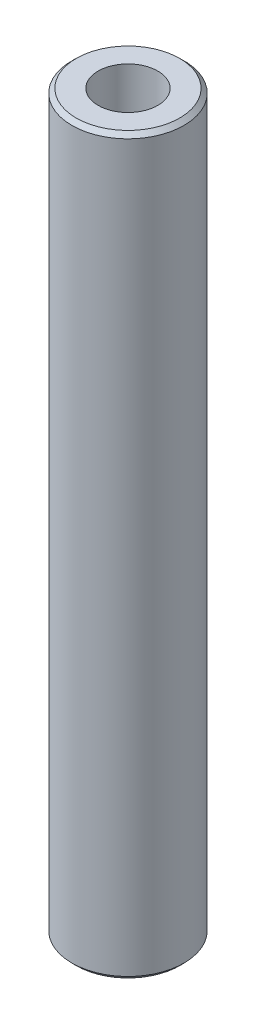
ISO-10303-21;
HEADER;
FILE_DESCRIPTION(('STEP AP214'),'2;1');
FILE_NAME('part.step','',(''),(''),'','','');
FILE_SCHEMA(('AUTOMOTIVE_DESIGN { 1 0 10303 214 1 1 1 1 }'));
ENDSEC;
DATA;
#1=APPLICATION_CONTEXT('core data for automotive mechanical design processes');
#2=APPLICATION_PROTOCOL_DEFINITION('international standard','automotive_design',2000,#1);
#3=PRODUCT_CONTEXT('',#1,'mechanical');
#4=PRODUCT('Part','Part','',(#3));
#5=PRODUCT_RELATED_PRODUCT_CATEGORY('part','',(#4));
#6=PRODUCT_DEFINITION_FORMATION('','',#4);
#7=PRODUCT_DEFINITION_CONTEXT('part definition',#1,'design');
#8=PRODUCT_DEFINITION('design','',#6,#7);
#9=PRODUCT_DEFINITION_SHAPE('','',#8);
#10=(LENGTH_UNIT() NAMED_UNIT(*) SI_UNIT(.MILLI.,.METRE.));
#11=(NAMED_UNIT(*) PLANE_ANGLE_UNIT() SI_UNIT($,.RADIAN.));
#12=(NAMED_UNIT(*) SI_UNIT($,.STERADIAN.) SOLID_ANGLE_UNIT());
#13=UNCERTAINTY_MEASURE_WITH_UNIT(LENGTH_MEASURE(1.E-05),#10,'distance_accuracy_value','');
#14=(GEOMETRIC_REPRESENTATION_CONTEXT(3) GLOBAL_UNCERTAINTY_ASSIGNED_CONTEXT((#13)) GLOBAL_UNIT_ASSIGNED_CONTEXT((#10,
#11,#12)) REPRESENTATION_CONTEXT('',''));
#15=CARTESIAN_POINT('',(0.,0.,0.));
#16=DIRECTION('',(0.,0.,1.));
#17=DIRECTION('',(1.,0.,0.));
#18=AXIS2_PLACEMENT_3D('',#15,#16,#17);
#19=CARTESIAN_POINT('',(0.,589.345693844291,0.));
#20=DIRECTION('',(0.,-1.,0.));
#21=DIRECTION('',(0.,0.,-1.));
#22=AXIS2_PLACEMENT_3D('',#19,#20,#21);
#23=CYLINDRICAL_SURFACE('',#22,45.);
#24=CARTESIAN_POINT('',(0.,585.949926731888,0.));
#25=DIRECTION('',(0.,1.,0.));
#26=DIRECTION('',(0.,0.,1.));
#27=AXIS2_PLACEMENT_3D('',#24,#25,#26);
#28=CIRCLE('',#27,45.);
#29=CARTESIAN_POINT('',(0.,585.949926731888,45.));
#30=VERTEX_POINT('',#29);
#31=EDGE_CURVE('E50',#30,#30,#28,.F.);
#32=ORIENTED_EDGE('',*,*,#31,.T.);
#33=EDGE_LOOP('',(#32));
#34=FACE_BOUND('',#33,.T.);
#35=CARTESIAN_POINT('',(0.,3.47621680951538,0.));
#36=DIRECTION('',(0.,1.,0.));
#37=DIRECTION('',(0.,0.,1.));
#38=AXIS2_PLACEMENT_3D('',#35,#36,#37);
#39=CIRCLE('',#38,45.);
#40=CARTESIAN_POINT('',(0.,3.47621680951538,45.));
#41=VERTEX_POINT('',#40);
#42=EDGE_CURVE('E51',#41,#41,#39,.T.);
#43=ORIENTED_EDGE('',*,*,#42,.T.);
#44=EDGE_LOOP('',(#43));
#45=FACE_BOUND('',#44,.T.);
#46=ADVANCED_FACE('F39',(#34,#45),#23,.T.);
#47=CARTESIAN_POINT('',(0.,589.345693844291,0.));
#48=DIRECTION('',(0.,1.,0.));
#49=DIRECTION('',(0.,0.,1.));
#50=AXIS2_PLACEMENT_3D('',#47,#48,#49);
#51=PLANE('',#50);
#52=CARTESIAN_POINT('',(0.,589.345693844291,0.));
#53=DIRECTION('',(0.,1.,0.));
#54=DIRECTION('',(0.,0.,1.));
#55=AXIS2_PLACEMENT_3D('',#52,#53,#54);
#56=CIRCLE('',#55,41.5237831904847);
#57=CARTESIAN_POINT('',(0.,589.345693844291,41.5237831904847));
#58=VERTEX_POINT('',#57);
#59=EDGE_CURVE('E54',#58,#58,#56,.T.);
#60=ORIENTED_EDGE('',*,*,#59,.T.);
#61=EDGE_LOOP('',(#60));
#62=FACE_BOUND('',#61,.T.);
#63=CARTESIAN_POINT('',(0.,589.345693844291,0.));
#64=DIRECTION('',(0.,1.,0.));
#65=DIRECTION('',(0.,0.,1.));
#66=AXIS2_PLACEMENT_3D('',#63,#64,#65);
#67=CIRCLE('',#66,23.9354806141811);
#68=CARTESIAN_POINT('',(0.,589.345693844291,23.9354806141811));
#69=VERTEX_POINT('',#68);
#70=EDGE_CURVE('E58',#69,#69,#67,.T.);
#71=ORIENTED_EDGE('',*,*,#70,.F.);
#72=EDGE_LOOP('',(#71));
#73=FACE_BOUND('',#72,.T.);
#74=ADVANCED_FACE('F69',(#62,#73),#51,.T.);
#75=CARTESIAN_POINT('',(0.,0.,0.));
#76=DIRECTION('',(0.,1.,0.));
#77=DIRECTION('',(0.,0.,1.));
#78=AXIS2_PLACEMENT_3D('',#75,#76,#77);
#79=PLANE('',#78);
#80=CARTESIAN_POINT('',(0.,0.,0.));
#81=DIRECTION('',(0.,1.,0.));
#82=DIRECTION('',(0.,0.,1.));
#83=AXIS2_PLACEMENT_3D('',#80,#81,#82);
#84=CIRCLE('',#83,41.6042328875967);
#85=CARTESIAN_POINT('',(0.,0.,41.6042328875967));
#86=VERTEX_POINT('',#85);
#87=EDGE_CURVE('E10',#86,#86,#84,.F.);
#88=ORIENTED_EDGE('',*,*,#87,.T.);
#89=EDGE_LOOP('',(#88));
#90=FACE_BOUND('',#89,.T.);
#91=CARTESIAN_POINT('',(0.,0.,0.));
#92=DIRECTION('',(0.,1.,0.));
#93=DIRECTION('',(0.,0.,1.));
#94=AXIS2_PLACEMENT_3D('',#91,#92,#93);
#95=CIRCLE('',#94,23.9354806141811);
#96=CARTESIAN_POINT('',(0.,0.,23.9354806141811));
#97=VERTEX_POINT('',#96);
#98=EDGE_CURVE('E63',#97,#97,#95,.T.);
#99=ORIENTED_EDGE('',*,*,#98,.T.);
#100=EDGE_LOOP('',(#99));
#101=FACE_BOUND('',#100,.T.);
#102=ADVANCED_FACE('F75',(#90,#101),#79,.F.);
#103=CARTESIAN_POINT('',(0.,589.345693844291,0.));
#104=DIRECTION('',(0.,-1.,0.));
#105=DIRECTION('',(0.,0.,-1.));
#106=AXIS2_PLACEMENT_3D('',#103,#104,#105);
#107=CYLINDRICAL_SURFACE('',#106,23.9354806141811);
#108=ORIENTED_EDGE('',*,*,#70,.T.);
#109=EDGE_LOOP('',(#108));
#110=FACE_BOUND('',#109,.T.);
#111=ORIENTED_EDGE('',*,*,#98,.F.);
#112=EDGE_LOOP('',(#111));
#113=FACE_BOUND('',#112,.T.);
#114=ADVANCED_FACE('F70',(#110,#113),#107,.F.);
#115=CARTESIAN_POINT('',(0.,589.345693844291,0.));
#116=DIRECTION('',(0.,-1.,0.));
#117=DIRECTION('',(0.,0.,-1.));
#118=AXIS2_PLACEMENT_3D('',#115,#116,#117);
#119=CONICAL_SURFACE('',#118,41.5237831904847,0.797104538597274);
#120=ORIENTED_EDGE('',*,*,#31,.F.);
#121=EDGE_LOOP('',(#120));
#122=FACE_BOUND('',#121,.T.);
#123=ORIENTED_EDGE('',*,*,#59,.F.);
#124=EDGE_LOOP('',(#123));
#125=FACE_BOUND('',#124,.T.);
#126=ADVANCED_FACE('F81',(#122,#125),#119,.T.);
#127=CARTESIAN_POINT('',(0.,3.47621680951538,0.));
#128=DIRECTION('',(0.,1.,0.));
#129=DIRECTION('',(0.,0.,1.));
#130=AXIS2_PLACEMENT_3D('',#127,#128,#129);
#131=CONICAL_SURFACE('',#130,45.,0.773691788197605);
#132=CARTESIAN_POINT('',(0.,0.,41.6042328875967));
#133=CARTESIAN_POINT('',(0.,0.0362105917657864,41.6396054616843));
#134=CARTESIAN_POINT('',(0.,0.072421183531571,41.6749780357718));
#135=CARTESIAN_POINT('',(0.,0.14484236706314,41.7457231839469));
#136=CARTESIAN_POINT('',(0.,0.181052958828925,41.7810957580344));
#137=CARTESIAN_POINT('',(0.,0.253474142360495,41.8518409062095));
#138=CARTESIAN_POINT('',(0.,0.28968473412628,41.887213480297));
#139=CARTESIAN_POINT('',(0.,0.362105917657852,41.9579586284721));
#140=CARTESIAN_POINT('',(0.,0.398316509423637,41.9933312025596));
#141=CARTESIAN_POINT('',(0.,0.470737692955207,42.0640763507347));
#142=CARTESIAN_POINT('',(0.,0.506948284720991,42.0994489248222));
#143=CARTESIAN_POINT('',(0.,0.579369468252562,42.1701940729973));
#144=CARTESIAN_POINT('',(0.,0.615580060018348,42.2055666470848));
#145=CARTESIAN_POINT('',(0.,0.688001243549918,42.2763117952599));
#146=CARTESIAN_POINT('',(0.,0.724211835315702,42.3116843693474));
#147=CARTESIAN_POINT('',(0.,0.796633018847272,42.3824295175225));
#148=CARTESIAN_POINT('',(0.,0.832843610613058,42.41780209161));
#149=CARTESIAN_POINT('',(0.,0.905264794144629,42.4885472397851));
#150=CARTESIAN_POINT('',(0.,0.941475385910414,42.5239198138726));
#151=CARTESIAN_POINT('',(0.,1.01389656944198,42.5946649620477));
#152=CARTESIAN_POINT('',(0.,1.05010716120777,42.6300375361352));
#153=CARTESIAN_POINT('',(0.,1.12252834473934,42.7007826843103));
#154=CARTESIAN_POINT('',(0.,1.15873893650512,42.7361552583978));
#155=CARTESIAN_POINT('',(0.,1.2311601200367,42.8069004065729));
#156=CARTESIAN_POINT('',(0.,1.26737071180248,42.8422729806604));
#157=CARTESIAN_POINT('',(0.,1.33979189533405,42.9130181288355));
#158=CARTESIAN_POINT('',(0.,1.37600248709984,42.948390702923));
#159=CARTESIAN_POINT('',(0.,1.44842367063141,43.0191358510981));
#160=CARTESIAN_POINT('',(0.,1.48463426239719,43.0545084251856));
#161=CARTESIAN_POINT('',(0.,1.55705544592876,43.1252535733607));
#162=CARTESIAN_POINT('',(0.,1.59326603769455,43.1606261474482));
#163=CARTESIAN_POINT('',(0.,1.66568722122612,43.2313712956233));
#164=CARTESIAN_POINT('',(0.,1.7018978129919,43.2667438697108));
#165=CARTESIAN_POINT('',(0.,1.77431899652347,43.3374890178859));
#166=CARTESIAN_POINT('',(0.,1.81052958828926,43.3728615919734));
#167=CARTESIAN_POINT('',(0.,1.88295077182083,43.4436067401485));
#168=CARTESIAN_POINT('',(0.,1.91916136358661,43.478979314236));
#169=CARTESIAN_POINT('',(0.,1.99158254711818,43.5497244624111));
#170=CARTESIAN_POINT('',(0.,2.02779313888397,43.5850970364986));
#171=CARTESIAN_POINT('',(0.,2.10021432241554,43.6558421846737));
#172=CARTESIAN_POINT('',(0.,2.13642491418133,43.6912147587612));
#173=CARTESIAN_POINT('',(0.,2.20884609771289,43.7619599069363));
#174=CARTESIAN_POINT('',(0.,2.24505668947868,43.7973324810238));
#175=CARTESIAN_POINT('',(0.,2.31747787301025,43.8680776291989));
#176=CARTESIAN_POINT('',(0.,2.35368846477604,43.9034502032864));
#177=CARTESIAN_POINT('',(0.,2.42610964830761,43.9741953514615));
#178=CARTESIAN_POINT('',(0.,2.46232024007339,44.0095679255491));
#179=CARTESIAN_POINT('',(0.,2.53474142360496,44.0803130737241));
#180=CARTESIAN_POINT('',(0.,2.57095201537075,44.1156856478117));
#181=CARTESIAN_POINT('',(0.,2.64337319890232,44.1864307959867));
#182=CARTESIAN_POINT('',(0.,2.6795837906681,44.2218033700743));
#183=CARTESIAN_POINT('',(0.,2.75200497419967,44.2925485182493));
#184=CARTESIAN_POINT('',(0.,2.78821556596546,44.3279210923369));
#185=CARTESIAN_POINT('',(0.,2.86063674949703,44.3986662405119));
#186=CARTESIAN_POINT('',(0.,2.89684734126281,44.4340388145995));
#187=CARTESIAN_POINT('',(0.,2.96926852479438,44.5047839627745));
#188=CARTESIAN_POINT('',(0.,3.00547911656017,44.5401565368621));
#189=CARTESIAN_POINT('',(0.,3.07790030009174,44.6109016850371));
#190=CARTESIAN_POINT('',(0.,3.11411089185752,44.6462742591247));
#191=CARTESIAN_POINT('',(0.,3.18653207538909,44.7170194072997));
#192=CARTESIAN_POINT('',(0.,3.22274266715488,44.7523919813873));
#193=CARTESIAN_POINT('',(0.,3.29516385068645,44.8231371295623));
#194=CARTESIAN_POINT('',(0.,3.33137444245223,44.8585097036499));
#195=CARTESIAN_POINT('',(0.,3.4037956259838,44.9292548518249));
#196=CARTESIAN_POINT('',(0.,3.44000621774959,44.9646274259125));
#197=CARTESIAN_POINT('',(0.,3.47621680951538,45.));
#198=B_SPLINE_CURVE_WITH_KNOTS('',3,(#132,#133,#134,#135,#136,#137,#138,#139,#140,#141,#142,
#143,#144,#145,#146,#147,#148,#149,#150,#151,#152,#153,#154,#155,#156,#157,#158,#159,#160,#161,
#162,#163,#164,#165,#166,#167,#168,#169,#170,#171,#172,#173,#174,#175,#176,#177,#178,#179,#180,
#181,#182,#183,#184,#185,#186,#187,#188,#189,#190,#191,#192,#193,#194,#195,#196,#197),
.UNSPECIFIED.,.F.,.F.,(4,2,2,2,2,2,2,2,2,2,2,2,2,2,2,2,2,2,2,2,2,2,2,2,2,2,2,2,2,2,2,2,4),(0.,
0.151861231334588,0.303722462669182,0.45558369400377,0.607444925338359,0.759306156672952,
0.91116738800754,1.06302861934213,1.21488985067672,1.36675108201131,1.5186123133459,
1.67047354468049,1.82233477601508,1.97419600734967,2.12605723868426,2.27791847001886,
2.42977970135344,2.58164093268803,2.73350216402263,2.88536339535721,3.0372246266918,
3.1890858580264,3.34094708936098,3.49280832069558,3.64466955203017,3.79653078336475,
3.94839201469935,4.10025324603394,4.25211447736852,4.40397570870312,4.55583694003771,
4.7076981713723,4.85955940270689),.UNSPECIFIED.);
#199=EDGE_CURVE('BSEAM45',#86,#41,#198,.T.);
#200=ORIENTED_EDGE('',*,*,#87,.F.);
#201=ORIENTED_EDGE('',*,*,#42,.F.);
#202=ORIENTED_EDGE('',*,*,#199,.T.);
#203=ORIENTED_EDGE('',*,*,#199,.F.);
#204=EDGE_LOOP('',(#200,#202,#201,#203));
#205=FACE_BOUND('',#204,.T.);
#206=ADVANCED_FACE('F45',(#205),#131,.T.);
#207=CLOSED_SHELL('',(#46,#74,#102,#114,#126,#206));
#208=MANIFOLD_SOLID_BREP('B2',#207);
#209=ADVANCED_BREP_SHAPE_REPRESENTATION('',(#18,#208),#14);
#210=SHAPE_DEFINITION_REPRESENTATION(#9,#209);
ENDSEC;
END-ISO-10303-21;
